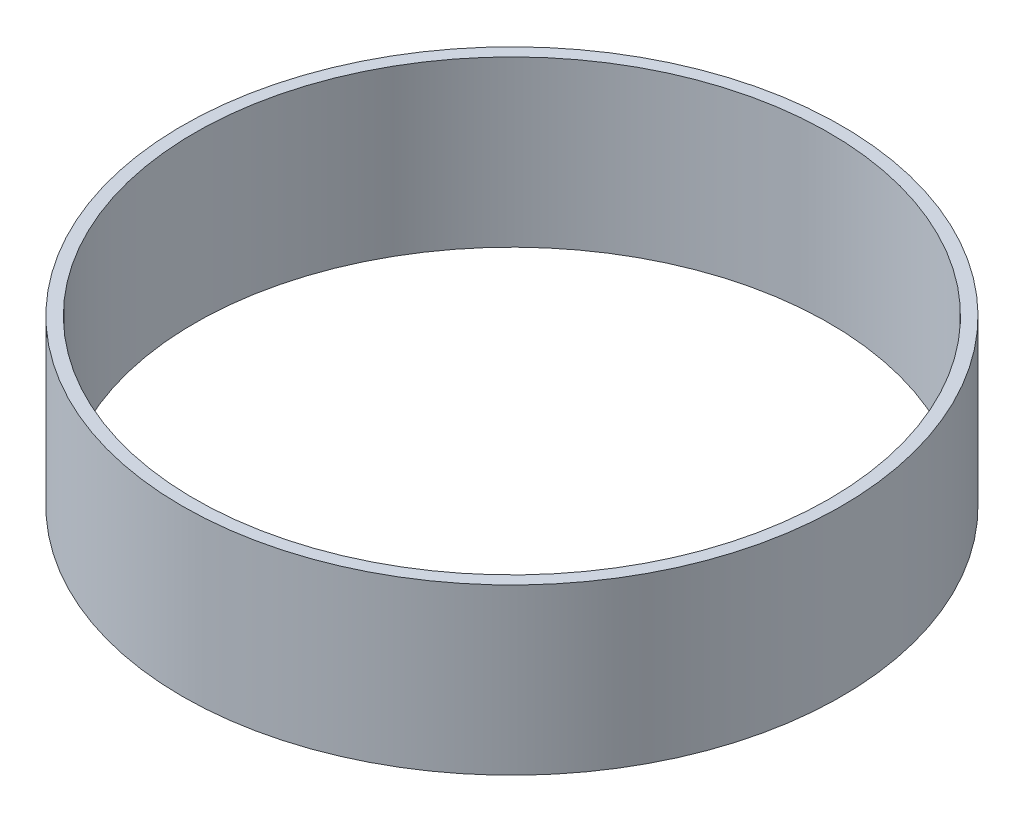
ISO-10303-21;
HEADER;
FILE_DESCRIPTION(('STEP AP214'),'2;1');
FILE_NAME('part.step','',(''),(''),'','','');
FILE_SCHEMA(('AUTOMOTIVE_DESIGN { 1 0 10303 214 1 1 1 1 }'));
ENDSEC;
DATA;
#1=APPLICATION_CONTEXT('core data for automotive mechanical design processes');
#2=APPLICATION_PROTOCOL_DEFINITION('international standard','automotive_design',2000,#1);
#3=PRODUCT_CONTEXT('',#1,'mechanical');
#4=PRODUCT('Part','Part','',(#3));
#5=PRODUCT_RELATED_PRODUCT_CATEGORY('part','',(#4));
#6=PRODUCT_DEFINITION_FORMATION('','',#4);
#7=PRODUCT_DEFINITION_CONTEXT('part definition',#1,'design');
#8=PRODUCT_DEFINITION('design','',#6,#7);
#9=PRODUCT_DEFINITION_SHAPE('','',#8);
#10=(LENGTH_UNIT() NAMED_UNIT(*) SI_UNIT(.MILLI.,.METRE.));
#11=(NAMED_UNIT(*) PLANE_ANGLE_UNIT() SI_UNIT($,.RADIAN.));
#12=(NAMED_UNIT(*) SI_UNIT($,.STERADIAN.) SOLID_ANGLE_UNIT());
#13=UNCERTAINTY_MEASURE_WITH_UNIT(LENGTH_MEASURE(1.E-05),#10,'distance_accuracy_value','');
#14=(GEOMETRIC_REPRESENTATION_CONTEXT(3) GLOBAL_UNCERTAINTY_ASSIGNED_CONTEXT((#13)) GLOBAL_UNIT_ASSIGNED_CONTEXT((#10,
#11,#12)) REPRESENTATION_CONTEXT('',''));
#15=CARTESIAN_POINT('',(0.,0.,0.));
#16=DIRECTION('',(0.,0.,1.));
#17=DIRECTION('',(1.,0.,0.));
#18=AXIS2_PLACEMENT_3D('',#15,#16,#17);
#19=CARTESIAN_POINT('',(0.,40.,0.));
#20=DIRECTION('',(0.,1.,0.));
#21=DIRECTION('',(0.,0.,1.));
#22=AXIS2_PLACEMENT_3D('',#19,#20,#21);
#23=PLANE('',#22);
#24=CARTESIAN_POINT('',(0.,40.,0.));
#25=DIRECTION('',(0.,1.,0.));
#26=DIRECTION('',(0.,0.,1.));
#27=AXIS2_PLACEMENT_3D('',#24,#25,#26);
#28=CIRCLE('',#27,80.);
#29=CARTESIAN_POINT('',(0.,40.,80.));
#30=VERTEX_POINT('',#29);
#31=EDGE_CURVE('E11',#30,#30,#28,.T.);
#32=ORIENTED_EDGE('',*,*,#31,.T.);
#33=EDGE_LOOP('',(#32));
#34=FACE_BOUND('',#33,.T.);
#35=CARTESIAN_POINT('',(0.,40.,0.));
#36=DIRECTION('',(0.,1.,0.));
#37=DIRECTION('',(1.,0.,0.));
#38=AXIS2_PLACEMENT_3D('',#35,#36,#37);
#39=CIRCLE('',#38,77.);
#40=CARTESIAN_POINT('',(77.,40.,0.));
#41=VERTEX_POINT('',#40);
#42=EDGE_CURVE('E49',#41,#41,#39,.T.);
#43=ORIENTED_EDGE('',*,*,#42,.F.);
#44=EDGE_LOOP('',(#43));
#45=FACE_BOUND('',#44,.T.);
#46=ADVANCED_FACE('F38',(#34,#45),#23,.T.);
#47=CARTESIAN_POINT('',(0.,0.,0.));
#48=DIRECTION('',(0.,1.,0.));
#49=DIRECTION('',(0.,0.,1.));
#50=AXIS2_PLACEMENT_3D('',#47,#48,#49);
#51=PLANE('',#50);
#52=CARTESIAN_POINT('',(0.,0.,0.));
#53=DIRECTION('',(0.,1.,0.));
#54=DIRECTION('',(0.,0.,1.));
#55=AXIS2_PLACEMENT_3D('',#52,#53,#54);
#56=CIRCLE('',#55,80.);
#57=CARTESIAN_POINT('',(0.,0.,80.));
#58=VERTEX_POINT('',#57);
#59=EDGE_CURVE('E42',#58,#58,#56,.T.);
#60=ORIENTED_EDGE('',*,*,#59,.F.);
#61=EDGE_LOOP('',(#60));
#62=FACE_BOUND('',#61,.T.);
#63=CARTESIAN_POINT('',(0.,0.,0.));
#64=DIRECTION('',(0.,1.,0.));
#65=DIRECTION('',(1.,0.,0.));
#66=AXIS2_PLACEMENT_3D('',#63,#64,#65);
#67=CIRCLE('',#66,77.);
#68=CARTESIAN_POINT('',(77.,0.,0.));
#69=VERTEX_POINT('',#68);
#70=EDGE_CURVE('E51',#69,#69,#67,.T.);
#71=ORIENTED_EDGE('',*,*,#70,.T.);
#72=EDGE_LOOP('',(#71));
#73=FACE_BOUND('',#72,.T.);
#74=ADVANCED_FACE('F61',(#62,#73),#51,.F.);
#75=CARTESIAN_POINT('',(0.,40.,0.));
#76=DIRECTION('',(0.,-1.,0.));
#77=DIRECTION('',(0.,0.,-1.));
#78=AXIS2_PLACEMENT_3D('',#75,#76,#77);
#79=CYLINDRICAL_SURFACE('',#78,80.);
#80=ORIENTED_EDGE('',*,*,#31,.F.);
#81=EDGE_LOOP('',(#80));
#82=FACE_BOUND('',#81,.T.);
#83=ORIENTED_EDGE('',*,*,#59,.T.);
#84=EDGE_LOOP('',(#83));
#85=FACE_BOUND('',#84,.T.);
#86=ADVANCED_FACE('F40',(#82,#85),#79,.T.);
#87=CARTESIAN_POINT('',(0.,40.,0.));
#88=DIRECTION('',(0.,-1.,0.));
#89=DIRECTION('',(0.,0.,-1.));
#90=AXIS2_PLACEMENT_3D('',#87,#88,#89);
#91=CYLINDRICAL_SURFACE('',#90,77.);
#92=ORIENTED_EDGE('',*,*,#42,.T.);
#93=EDGE_LOOP('',(#92));
#94=FACE_BOUND('',#93,.T.);
#95=ORIENTED_EDGE('',*,*,#70,.F.);
#96=EDGE_LOOP('',(#95));
#97=FACE_BOUND('',#96,.T.);
#98=ADVANCED_FACE('F57',(#94,#97),#91,.F.);
#99=CLOSED_SHELL('',(#46,#74,#86,#98));
#100=MANIFOLD_SOLID_BREP('B2',#99);
#101=ADVANCED_BREP_SHAPE_REPRESENTATION('',(#18,#100),#14);
#102=SHAPE_DEFINITION_REPRESENTATION(#9,#101);
ENDSEC;
END-ISO-10303-21;
